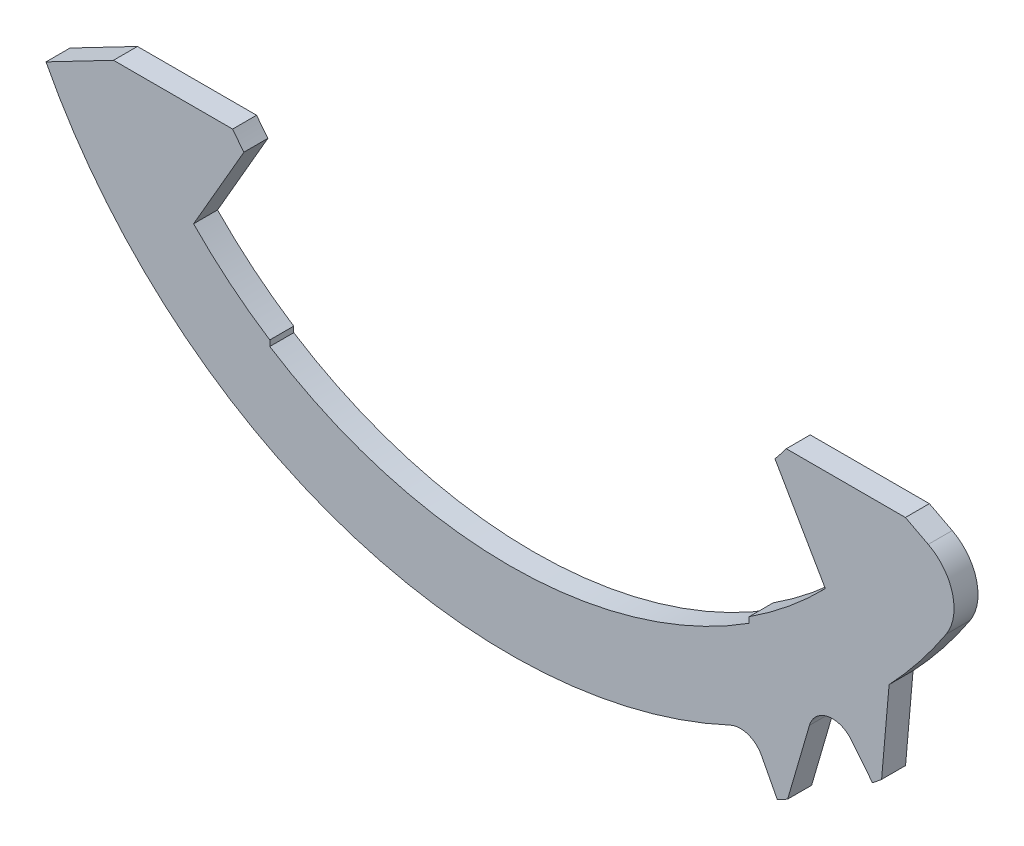
ISO-10303-21;
HEADER;
FILE_DESCRIPTION(('STEP AP214'),'2;1');
FILE_NAME('part.step','',(''),(''),'','','');
FILE_SCHEMA(('AUTOMOTIVE_DESIGN { 1 0 10303 214 1 1 1 1 }'));
ENDSEC;
DATA;
#1=APPLICATION_CONTEXT('core data for automotive mechanical design processes');
#2=APPLICATION_PROTOCOL_DEFINITION('international standard','automotive_design',2000,#1);
#3=PRODUCT_CONTEXT('',#1,'mechanical');
#4=PRODUCT('Part','Part','',(#3));
#5=PRODUCT_RELATED_PRODUCT_CATEGORY('part','',(#4));
#6=PRODUCT_DEFINITION_FORMATION('','',#4);
#7=PRODUCT_DEFINITION_CONTEXT('part definition',#1,'design');
#8=PRODUCT_DEFINITION('design','',#6,#7);
#9=PRODUCT_DEFINITION_SHAPE('','',#8);
#10=(LENGTH_UNIT() NAMED_UNIT(*) SI_UNIT(.MILLI.,.METRE.));
#11=(NAMED_UNIT(*) PLANE_ANGLE_UNIT() SI_UNIT($,.RADIAN.));
#12=(NAMED_UNIT(*) SI_UNIT($,.STERADIAN.) SOLID_ANGLE_UNIT());
#13=UNCERTAINTY_MEASURE_WITH_UNIT(LENGTH_MEASURE(1.E-05),#10,'distance_accuracy_value','');
#14=(GEOMETRIC_REPRESENTATION_CONTEXT(3) GLOBAL_UNCERTAINTY_ASSIGNED_CONTEXT((#13)) GLOBAL_UNIT_ASSIGNED_CONTEXT((#10,
#11,#12)) REPRESENTATION_CONTEXT('',''));
#15=CARTESIAN_POINT('',(0.,0.,0.));
#16=DIRECTION('',(0.,0.,1.));
#17=DIRECTION('',(1.,0.,0.));
#18=AXIS2_PLACEMENT_3D('',#15,#16,#17);
#19=CARTESIAN_POINT('',(4.81536330400592,-10.3330671269683,-0.00100000000000002));
#20=DIRECTION('',(0.,0.,1.));
#21=DIRECTION('',(1.,0.,0.));
#22=AXIS2_PLACEMENT_3D('',#19,#20,#21);
#23=CYLINDRICAL_SURFACE('',#22,0.5);
#24=DIRECTION('',(0.,0.,1.));
#25=VECTOR('',#24,1.);
#26=CARTESIAN_POINT('',(4.60416315909338,-9.87986242841707,-0.00100000000000002));
#27=LINE('',#26,#25);
#28=CARTESIAN_POINT('',(4.60416315909338,-9.87986242841707,0.));
#29=VERTEX_POINT('',#28);
#30=CARTESIAN_POINT('',(4.60416315909338,-9.87986242841707,0.5));
#31=VERTEX_POINT('',#30);
#32=EDGE_CURVE('E233',#29,#31,#27,.T.);
#33=ORIENTED_EDGE('',*,*,#32,.F.);
#34=CARTESIAN_POINT('',(4.81536330400592,-10.3330671269683,0.));
#35=DIRECTION('',(0.,0.,-1.));
#36=DIRECTION('',(-1.,0.,0.));
#37=AXIS2_PLACEMENT_3D('',#34,#35,#36);
#38=CIRCLE('',#37,0.5);
#39=CARTESIAN_POINT('',(5.25886872059503,-10.1021928203508,0.));
#40=VERTEX_POINT('',#39);
#41=EDGE_CURVE('E384',#40,#29,#38,.F.);
#42=ORIENTED_EDGE('',*,*,#41,.F.);
#43=DIRECTION('',(0.,0.,1.));
#44=VECTOR('',#43,1.);
#45=CARTESIAN_POINT('',(5.25886872059503,-10.1021928203508,-0.00100000000000002));
#46=LINE('',#45,#44);
#47=CARTESIAN_POINT('',(5.25886872059503,-10.1021928203508,0.5));
#48=VERTEX_POINT('',#47);
#49=EDGE_CURVE('E393',#40,#48,#46,.T.);
#50=ORIENTED_EDGE('',*,*,#49,.T.);
#51=CARTESIAN_POINT('',(4.81536330400592,-10.3330671269683,0.5));
#52=DIRECTION('',(0.,0.,1.));
#53=DIRECTION('',(0.195090322016125,0.980785280403231,0.));
#54=AXIS2_PLACEMENT_3D('',#51,#52,#53);
#55=CIRCLE('',#54,0.5);
#56=EDGE_CURVE('E390',#48,#31,#55,.T.);
#57=ORIENTED_EDGE('',*,*,#56,.T.);
#58=EDGE_LOOP('',(#33,#42,#50,#57));
#59=FACE_BOUND('',#58,.T.);
#60=ADVANCED_FACE('F68',(#59),#23,.F.);
#61=CARTESIAN_POINT('',(0.,0.,0.5));
#62=DIRECTION('',(0.,0.,-1.));
#63=DIRECTION('',(-1.,0.,0.));
#64=AXIS2_PLACEMENT_3D('',#61,#62,#63);
#65=CYLINDRICAL_SURFACE('',#64,12.1);
#66=CARTESIAN_POINT('',(0.,0.,0.));
#67=DIRECTION('',(0.,0.,1.));
#68=DIRECTION('',(1.,0.,0.));
#69=AXIS2_PLACEMENT_3D('',#66,#67,#68);
#70=CIRCLE('',#69,12.1);
#71=CARTESIAN_POINT('',(7.57367401342711,-9.43660224542387,0.));
#72=VERTEX_POINT('',#71);
#73=CARTESIAN_POINT('',(7.76317902804415,-9.28132810423893,0.));
#74=VERTEX_POINT('',#73);
#75=EDGE_CURVE('E288',#72,#74,#70,.T.);
#76=ORIENTED_EDGE('',*,*,#75,.T.);
#77=DIRECTION('',(0.,0.,1.));
#78=VECTOR('',#77,1.);
#79=CARTESIAN_POINT('',(7.76317902804415,-9.28132810423893,-0.00100000000000002));
#80=LINE('',#79,#78);
#81=CARTESIAN_POINT('',(7.76317902804415,-9.28132810423893,0.5));
#82=VERTEX_POINT('',#81);
#83=EDGE_CURVE('E355',#74,#82,#80,.T.);
#84=ORIENTED_EDGE('',*,*,#83,.T.);
#85=CARTESIAN_POINT('',(0.,0.,0.5));
#86=DIRECTION('',(0.,0.,1.));
#87=DIRECTION('',(1.,0.,0.));
#88=AXIS2_PLACEMENT_3D('',#85,#86,#87);
#89=CIRCLE('',#88,12.1);
#90=CARTESIAN_POINT('',(7.57367401342711,-9.43660224542387,0.5));
#91=VERTEX_POINT('',#90);
#92=EDGE_CURVE('E251',#91,#82,#89,.T.);
#93=ORIENTED_EDGE('',*,*,#92,.F.);
#94=DIRECTION('',(0.,0.,1.));
#95=VECTOR('',#94,1.);
#96=CARTESIAN_POINT('',(7.57367401342711,-9.43660224542387,-0.00100000000000002));
#97=LINE('',#96,#95);
#98=EDGE_CURVE('E372',#72,#91,#97,.T.);
#99=ORIENTED_EDGE('',*,*,#98,.F.);
#100=EDGE_LOOP('',(#76,#84,#93,#99));
#101=FACE_BOUND('',#100,.T.);
#102=ADVANCED_FACE('F434',(#101),#65,.T.);
#103=CARTESIAN_POINT('',(5.5871582201439,-10.7328310814565,0.));
#104=VERTEX_POINT('',#103);
#105=CARTESIAN_POINT('',(5.80331443124744,-10.6175110836804,0.));
#106=VERTEX_POINT('',#105);
#107=EDGE_CURVE('E291',#104,#106,#70,.T.);
#108=ORIENTED_EDGE('',*,*,#107,.T.);
#109=DIRECTION('',(0.,0.,1.));
#110=VECTOR('',#109,1.);
#111=CARTESIAN_POINT('',(5.80331443124744,-10.6175110836804,-0.00100000000000002));
#112=LINE('',#111,#110);
#113=CARTESIAN_POINT('',(5.80331443124744,-10.6175110836804,0.5));
#114=VERTEX_POINT('',#113);
#115=EDGE_CURVE('E373',#106,#114,#112,.T.);
#116=ORIENTED_EDGE('',*,*,#115,.T.);
#117=CARTESIAN_POINT('',(5.5871582201439,-10.7328310814565,0.5));
#118=VERTEX_POINT('',#117);
#119=EDGE_CURVE('E254',#118,#114,#89,.T.);
#120=ORIENTED_EDGE('',*,*,#119,.F.);
#121=DIRECTION('',(0.,0.,1.));
#122=VECTOR('',#121,1.);
#123=CARTESIAN_POINT('',(5.5871582201439,-10.7328310814565,-0.00100000000000002));
#124=LINE('',#123,#122);
#125=EDGE_CURVE('E392',#104,#118,#124,.T.);
#126=ORIENTED_EDGE('',*,*,#125,.F.);
#127=EDGE_LOOP('',(#108,#116,#120,#126));
#128=FACE_BOUND('',#127,.T.);
#129=ADVANCED_FACE('F451',(#128),#65,.T.);
#130=CARTESIAN_POINT('',(0.,0.,0.5));
#131=DIRECTION('',(0.,0.,-1.));
#132=DIRECTION('',(-1.,0.,0.));
#133=AXIS2_PLACEMENT_3D('',#130,#131,#132);
#134=CYLINDRICAL_SURFACE('',#133,7.2);
#135=CARTESIAN_POINT('',(0.,0.,0.));
#136=DIRECTION('',(0.,0.,-1.));
#137=DIRECTION('',(-1.,0.,0.));
#138=AXIS2_PLACEMENT_3D('',#135,#136,#137);
#139=CIRCLE('',#138,7.2);
#140=CARTESIAN_POINT('',(5.77494588719236,-4.3,0.));
#141=VERTEX_POINT('',#140);
#142=CARTESIAN_POINT('',(5.53923133011576,-4.5996647999027,0.));
#143=VERTEX_POINT('',#142);
#144=EDGE_CURVE('E265',#141,#143,#139,.T.);
#145=ORIENTED_EDGE('',*,*,#144,.T.);
#146=DIRECTION('',(0.,0.,-1.));
#147=VECTOR('',#146,1.);
#148=CARTESIAN_POINT('',(5.53923133011576,-4.5996647999027,0.5));
#149=LINE('',#148,#147);
#150=CARTESIAN_POINT('',(5.53923133011576,-4.5996647999027,0.5));
#151=VERTEX_POINT('',#150);
#152=EDGE_CURVE('E328',#151,#143,#149,.T.);
#153=ORIENTED_EDGE('',*,*,#152,.F.);
#154=CARTESIAN_POINT('',(0.,0.,0.5));
#155=DIRECTION('',(0.,0.,-1.));
#156=DIRECTION('',(-1.,0.,0.));
#157=AXIS2_PLACEMENT_3D('',#154,#155,#156);
#158=CIRCLE('',#157,7.2);
#159=CARTESIAN_POINT('',(5.77494588719236,-4.3,0.5));
#160=VERTEX_POINT('',#159);
#161=EDGE_CURVE('E296',#160,#151,#158,.T.);
#162=ORIENTED_EDGE('',*,*,#161,.F.);
#163=DIRECTION('',(0.,0.,-1.));
#164=VECTOR('',#163,1.);
#165=CARTESIAN_POINT('',(5.77494588719236,-4.3,0.5));
#166=LINE('',#165,#164);
#167=EDGE_CURVE('E264',#160,#141,#166,.T.);
#168=ORIENTED_EDGE('',*,*,#167,.T.);
#169=EDGE_LOOP('',(#145,#153,#162,#168));
#170=FACE_BOUND('',#169,.T.);
#171=ADVANCED_FACE('F512',(#170),#134,.F.);
#172=CARTESIAN_POINT('',(5.53923133011576,-4.5996647999027,0.5));
#173=DIRECTION('',(0.866025403784438,0.500000000000001,0.));
#174=DIRECTION('',(-0.500000000000001,0.866025403784438,0.));
#175=AXIS2_PLACEMENT_3D('',#172,#173,#174);
#176=PLANE('',#175);
#177=DIRECTION('',(0.500000000000001,-0.866025403784438,0.));
#178=VECTOR('',#177,1.);
#179=CARTESIAN_POINT('',(5.53923133011576,-4.5996647999027,0.));
#180=LINE('',#179,#178);
#181=CARTESIAN_POINT('',(6.59,-6.41964952314377,0.));
#182=VERTEX_POINT('',#181);
#183=EDGE_CURVE('E268',#143,#182,#180,.T.);
#184=ORIENTED_EDGE('',*,*,#183,.T.);
#185=DIRECTION('',(0.,0.,-1.));
#186=VECTOR('',#185,1.);
#187=CARTESIAN_POINT('',(6.59,-6.41964952314377,0.5));
#188=LINE('',#187,#186);
#189=CARTESIAN_POINT('',(6.59,-6.41964952314377,0.5));
#190=VERTEX_POINT('',#189);
#191=EDGE_CURVE('E325',#190,#182,#188,.T.);
#192=ORIENTED_EDGE('',*,*,#191,.F.);
#193=DIRECTION('',(0.500000000000001,-0.866025403784438,0.));
#194=VECTOR('',#193,1.);
#195=CARTESIAN_POINT('',(5.53923133011576,-4.5996647999027,0.5));
#196=LINE('',#195,#194);
#197=EDGE_CURVE('E400',#151,#190,#196,.T.);
#198=ORIENTED_EDGE('',*,*,#197,.F.);
#199=ORIENTED_EDGE('',*,*,#152,.T.);
#200=EDGE_LOOP('',(#184,#192,#198,#199));
#201=FACE_BOUND('',#200,.T.);
#202=ADVANCED_FACE('F509',(#201),#176,.F.);
#203=CARTESIAN_POINT('',(0.,0.,0.5));
#204=DIRECTION('',(0.,0.,-1.));
#205=DIRECTION('',(-1.,0.,0.));
#206=AXIS2_PLACEMENT_3D('',#203,#204,#205);
#207=CYLINDRICAL_SURFACE('',#206,9.2);
#208=CARTESIAN_POINT('',(0.,0.,0.));
#209=DIRECTION('',(0.,0.,-1.));
#210=DIRECTION('',(1.,0.,0.));
#211=AXIS2_PLACEMENT_3D('',#208,#209,#210);
#212=CIRCLE('',#211,9.2);
#213=CARTESIAN_POINT('',(5.,-7.72269383052313,0.));
#214=VERTEX_POINT('',#213);
#215=EDGE_CURVE('E271',#182,#214,#212,.T.);
#216=ORIENTED_EDGE('',*,*,#215,.T.);
#217=DIRECTION('',(0.,0.,-1.));
#218=VECTOR('',#217,1.);
#219=CARTESIAN_POINT('',(5.,-7.72269383052313,0.5));
#220=LINE('',#219,#218);
#221=CARTESIAN_POINT('',(5.,-7.72269383052313,0.5));
#222=VERTEX_POINT('',#221);
#223=EDGE_CURVE('E322',#222,#214,#220,.T.);
#224=ORIENTED_EDGE('',*,*,#223,.F.);
#225=CARTESIAN_POINT('',(0.,0.,0.5));
#226=DIRECTION('',(0.,0.,-1.));
#227=DIRECTION('',(1.,0.,0.));
#228=AXIS2_PLACEMENT_3D('',#225,#226,#227);
#229=CIRCLE('',#228,9.2);
#230=EDGE_CURVE('E402',#190,#222,#229,.T.);
#231=ORIENTED_EDGE('',*,*,#230,.F.);
#232=ORIENTED_EDGE('',*,*,#191,.T.);
#233=EDGE_LOOP('',(#216,#224,#231,#232));
#234=FACE_BOUND('',#233,.T.);
#235=ADVANCED_FACE('F505',(#234),#207,.F.);
#236=CARTESIAN_POINT('',(5.,-7.72269383052313,0.5));
#237=DIRECTION('',(1.,0.,0.));
#238=DIRECTION('',(0.,0.,-1.));
#239=AXIS2_PLACEMENT_3D('',#236,#237,#238);
#240=PLANE('',#239);
#241=DIRECTION('',(0.,-1.,0.));
#242=VECTOR('',#241,1.);
#243=CARTESIAN_POINT('',(5.,-7.72269383052313,0.));
#244=LINE('',#243,#242);
#245=CARTESIAN_POINT('',(4.99999999999999,-7.84155596804614,0.));
#246=VERTEX_POINT('',#245);
#247=EDGE_CURVE('E273',#214,#246,#244,.T.);
#248=ORIENTED_EDGE('',*,*,#247,.T.);
#249=DIRECTION('',(0.,0.,-1.));
#250=VECTOR('',#249,1.);
#251=CARTESIAN_POINT('',(4.99999999999999,-7.84155596804614,0.5));
#252=LINE('',#251,#250);
#253=CARTESIAN_POINT('',(4.99999999999999,-7.84155596804614,0.5));
#254=VERTEX_POINT('',#253);
#255=EDGE_CURVE('E319',#254,#246,#252,.T.);
#256=ORIENTED_EDGE('',*,*,#255,.F.);
#257=DIRECTION('',(0.,-1.,0.));
#258=VECTOR('',#257,1.);
#259=CARTESIAN_POINT('',(5.,-7.72269383052313,0.5));
#260=LINE('',#259,#258);
#261=EDGE_CURVE('E404',#222,#254,#260,.T.);
#262=ORIENTED_EDGE('',*,*,#261,.F.);
#263=ORIENTED_EDGE('',*,*,#223,.T.);
#264=EDGE_LOOP('',(#248,#256,#262,#263));
#265=FACE_BOUND('',#264,.T.);
#266=ADVANCED_FACE('F501',(#265),#240,.F.);
#267=CARTESIAN_POINT('',(0.,0.,0.5));
#268=DIRECTION('',(0.,0.,-1.));
#269=DIRECTION('',(-1.,0.,0.));
#270=AXIS2_PLACEMENT_3D('',#267,#268,#269);
#271=CYLINDRICAL_SURFACE('',#270,9.3);
#272=CARTESIAN_POINT('',(0.,0.,0.));
#273=DIRECTION('',(0.,0.,-1.));
#274=DIRECTION('',(1.,0.,0.));
#275=AXIS2_PLACEMENT_3D('',#272,#273,#274);
#276=CIRCLE('',#275,9.3);
#277=CARTESIAN_POINT('',(-5.,-7.84155596804614,0.));
#278=VERTEX_POINT('',#277);
#279=EDGE_CURVE('E275',#246,#278,#276,.T.);
#280=ORIENTED_EDGE('',*,*,#279,.T.);
#281=DIRECTION('',(0.,0.,-1.));
#282=VECTOR('',#281,1.);
#283=CARTESIAN_POINT('',(-5.,-7.84155596804614,0.5));
#284=LINE('',#283,#282);
#285=CARTESIAN_POINT('',(-5.,-7.84155596804614,0.5));
#286=VERTEX_POINT('',#285);
#287=EDGE_CURVE('E316',#286,#278,#284,.T.);
#288=ORIENTED_EDGE('',*,*,#287,.F.);
#289=CARTESIAN_POINT('',(0.,0.,0.5));
#290=DIRECTION('',(0.,0.,-1.));
#291=DIRECTION('',(1.,0.,0.));
#292=AXIS2_PLACEMENT_3D('',#289,#290,#291);
#293=CIRCLE('',#292,9.3);
#294=EDGE_CURVE('E406',#254,#286,#293,.T.);
#295=ORIENTED_EDGE('',*,*,#294,.F.);
#296=ORIENTED_EDGE('',*,*,#255,.T.);
#297=EDGE_LOOP('',(#280,#288,#295,#296));
#298=FACE_BOUND('',#297,.T.);
#299=ADVANCED_FACE('F497',(#298),#271,.F.);
#300=CARTESIAN_POINT('',(-5.,-7.72269383052313,0.5));
#301=DIRECTION('',(-1.,0.,0.));
#302=DIRECTION('',(0.,0.,1.));
#303=AXIS2_PLACEMENT_3D('',#300,#301,#302);
#304=PLANE('',#303);
#305=DIRECTION('',(0.,1.,0.));
#306=VECTOR('',#305,1.);
#307=CARTESIAN_POINT('',(-5.,-7.72269383052313,0.));
#308=LINE('',#307,#306);
#309=CARTESIAN_POINT('',(-5.00000000000001,-7.72269383052313,0.));
#310=VERTEX_POINT('',#309);
#311=EDGE_CURVE('E277',#278,#310,#308,.T.);
#312=ORIENTED_EDGE('',*,*,#311,.T.);
#313=DIRECTION('',(0.,0.,-1.));
#314=VECTOR('',#313,1.);
#315=CARTESIAN_POINT('',(-5.00000000000001,-7.72269383052313,0.5));
#316=LINE('',#315,#314);
#317=CARTESIAN_POINT('',(-5.00000000000001,-7.72269383052313,0.5));
#318=VERTEX_POINT('',#317);
#319=EDGE_CURVE('E313',#318,#310,#316,.T.);
#320=ORIENTED_EDGE('',*,*,#319,.F.);
#321=DIRECTION('',(0.,1.,0.));
#322=VECTOR('',#321,1.);
#323=CARTESIAN_POINT('',(-5.,-7.72269383052313,0.5));
#324=LINE('',#323,#322);
#325=EDGE_CURVE('E408',#286,#318,#324,.T.);
#326=ORIENTED_EDGE('',*,*,#325,.F.);
#327=ORIENTED_EDGE('',*,*,#287,.T.);
#328=EDGE_LOOP('',(#312,#320,#326,#327));
#329=FACE_BOUND('',#328,.T.);
#330=ADVANCED_FACE('F493',(#329),#304,.F.);
#331=CARTESIAN_POINT('',(0.,0.,0.5));
#332=DIRECTION('',(0.,0.,-1.));
#333=DIRECTION('',(-1.,0.,0.));
#334=AXIS2_PLACEMENT_3D('',#331,#332,#333);
#335=CYLINDRICAL_SURFACE('',#334,9.2);
#336=CARTESIAN_POINT('',(0.,0.,0.));
#337=DIRECTION('',(0.,0.,-1.));
#338=DIRECTION('',(1.,0.,0.));
#339=AXIS2_PLACEMENT_3D('',#336,#337,#338);
#340=CIRCLE('',#339,9.2);
#341=CARTESIAN_POINT('',(-6.59,-6.41964952314377,0.));
#342=VERTEX_POINT('',#341);
#343=EDGE_CURVE('E279',#310,#342,#340,.T.);
#344=ORIENTED_EDGE('',*,*,#343,.T.);
#345=DIRECTION('',(0.,0.,-1.));
#346=VECTOR('',#345,1.);
#347=CARTESIAN_POINT('',(-6.59,-6.41964952314377,0.5));
#348=LINE('',#347,#346);
#349=CARTESIAN_POINT('',(-6.59,-6.41964952314377,0.5));
#350=VERTEX_POINT('',#349);
#351=EDGE_CURVE('E310',#350,#342,#348,.T.);
#352=ORIENTED_EDGE('',*,*,#351,.F.);
#353=CARTESIAN_POINT('',(0.,0.,0.5));
#354=DIRECTION('',(0.,0.,-1.));
#355=DIRECTION('',(1.,0.,0.));
#356=AXIS2_PLACEMENT_3D('',#353,#354,#355);
#357=CIRCLE('',#356,9.2);
#358=EDGE_CURVE('E410',#318,#350,#357,.T.);
#359=ORIENTED_EDGE('',*,*,#358,.F.);
#360=ORIENTED_EDGE('',*,*,#319,.T.);
#361=EDGE_LOOP('',(#344,#352,#359,#360));
#362=FACE_BOUND('',#361,.T.);
#363=ADVANCED_FACE('F489',(#362),#335,.F.);
#364=CARTESIAN_POINT('',(-5.53923133011576,-4.5996647999027,0.5));
#365=DIRECTION('',(-0.866025403784438,0.500000000000001,0.));
#366=DIRECTION('',(-0.500000000000001,-0.866025403784438,0.));
#367=AXIS2_PLACEMENT_3D('',#364,#365,#366);
#368=PLANE('',#367);
#369=DIRECTION('',(0.500000000000001,0.866025403784438,0.));
#370=VECTOR('',#369,1.);
#371=CARTESIAN_POINT('',(-5.53923133011576,-4.5996647999027,0.));
#372=LINE('',#371,#370);
#373=CARTESIAN_POINT('',(-5.53923133011576,-4.5996647999027,0.));
#374=VERTEX_POINT('',#373);
#375=EDGE_CURVE('E281',#342,#374,#372,.T.);
#376=ORIENTED_EDGE('',*,*,#375,.T.);
#377=DIRECTION('',(0.,0.,-1.));
#378=VECTOR('',#377,1.);
#379=CARTESIAN_POINT('',(-5.53923133011576,-4.5996647999027,0.5));
#380=LINE('',#379,#378);
#381=CARTESIAN_POINT('',(-5.53923133011576,-4.5996647999027,0.5));
#382=VERTEX_POINT('',#381);
#383=EDGE_CURVE('E307',#382,#374,#380,.T.);
#384=ORIENTED_EDGE('',*,*,#383,.F.);
#385=DIRECTION('',(0.500000000000001,0.866025403784438,0.));
#386=VECTOR('',#385,1.);
#387=CARTESIAN_POINT('',(-5.53923133011576,-4.5996647999027,0.5));
#388=LINE('',#387,#386);
#389=EDGE_CURVE('E412',#350,#382,#388,.T.);
#390=ORIENTED_EDGE('',*,*,#389,.F.);
#391=ORIENTED_EDGE('',*,*,#351,.T.);
#392=EDGE_LOOP('',(#376,#384,#390,#391));
#393=FACE_BOUND('',#392,.T.);
#394=ADVANCED_FACE('F486',(#393),#368,.F.);
#395=CARTESIAN_POINT('',(0.,0.,0.5));
#396=DIRECTION('',(0.,0.,-1.));
#397=DIRECTION('',(-1.,0.,0.));
#398=AXIS2_PLACEMENT_3D('',#395,#396,#397);
#399=CYLINDRICAL_SURFACE('',#398,7.2);
#400=CARTESIAN_POINT('',(0.,0.,0.));
#401=DIRECTION('',(0.,0.,-1.));
#402=DIRECTION('',(1.,0.,0.));
#403=AXIS2_PLACEMENT_3D('',#400,#401,#402);
#404=CIRCLE('',#403,7.2);
#405=CARTESIAN_POINT('',(-5.77494588719236,-4.3,0.));
#406=VERTEX_POINT('',#405);
#407=EDGE_CURVE('E283',#374,#406,#404,.T.);
#408=ORIENTED_EDGE('',*,*,#407,.T.);
#409=DIRECTION('',(0.,0.,-1.));
#410=VECTOR('',#409,1.);
#411=CARTESIAN_POINT('',(-5.77494588719236,-4.3,0.5));
#412=LINE('',#411,#410);
#413=CARTESIAN_POINT('',(-5.77494588719236,-4.3,0.5));
#414=VERTEX_POINT('',#413);
#415=EDGE_CURVE('E304',#414,#406,#412,.T.);
#416=ORIENTED_EDGE('',*,*,#415,.F.);
#417=CARTESIAN_POINT('',(0.,0.,0.5));
#418=DIRECTION('',(0.,0.,-1.));
#419=DIRECTION('',(1.,0.,0.));
#420=AXIS2_PLACEMENT_3D('',#417,#418,#419);
#421=CIRCLE('',#420,7.2);
#422=EDGE_CURVE('E256',#382,#414,#421,.T.);
#423=ORIENTED_EDGE('',*,*,#422,.F.);
#424=ORIENTED_EDGE('',*,*,#383,.T.);
#425=EDGE_LOOP('',(#408,#416,#423,#424));
#426=FACE_BOUND('',#425,.T.);
#427=ADVANCED_FACE('F418',(#426),#399,.F.);
#428=CARTESIAN_POINT('',(-8.26022314597606,-4.3,0.5));
#429=DIRECTION('',(0.,-1.,0.));
#430=DIRECTION('',(1.,0.,0.));
#431=AXIS2_PLACEMENT_3D('',#428,#429,#430);
#432=PLANE('',#431);
#433=DIRECTION('',(-1.,0.,0.));
#434=VECTOR('',#433,1.);
#435=CARTESIAN_POINT('',(-8.26022314597606,-4.3,0.));
#436=LINE('',#435,#434);
#437=CARTESIAN_POINT('',(-8.26022314597606,-4.3,0.));
#438=VERTEX_POINT('',#437);
#439=EDGE_CURVE('E285',#406,#438,#436,.T.);
#440=ORIENTED_EDGE('',*,*,#439,.T.);
#441=DIRECTION('',(0.,0.,-1.));
#442=VECTOR('',#441,1.);
#443=CARTESIAN_POINT('',(-8.26022314597606,-4.3,0.5));
#444=LINE('',#443,#442);
#445=CARTESIAN_POINT('',(-8.26022314597606,-4.3,0.5));
#446=VERTEX_POINT('',#445);
#447=EDGE_CURVE('E302',#446,#438,#444,.T.);
#448=ORIENTED_EDGE('',*,*,#447,.F.);
#449=DIRECTION('',(-1.,0.,0.));
#450=VECTOR('',#449,1.);
#451=CARTESIAN_POINT('',(-8.26022314597606,-4.3,0.5));
#452=LINE('',#451,#450);
#453=EDGE_CURVE('E249',#414,#446,#452,.T.);
#454=ORIENTED_EDGE('',*,*,#453,.F.);
#455=ORIENTED_EDGE('',*,*,#415,.T.);
#456=EDGE_LOOP('',(#440,#448,#454,#455));
#457=FACE_BOUND('',#456,.T.);
#458=ADVANCED_FACE('F422',(#457),#432,.F.);
#459=CARTESIAN_POINT('',(-8.26022314597606,-4.3,0.5));
#460=DIRECTION('',(0.461748613235031,-0.887010833178223,0.));
#461=DIRECTION('',(0.887010833178223,0.461748613235031,0.));
#462=AXIS2_PLACEMENT_3D('',#459,#460,#461);
#463=PLANE('',#462);
#464=DIRECTION('',(-0.887010833178223,-0.461748613235031,0.));
#465=VECTOR('',#464,1.);
#466=CARTESIAN_POINT('',(-8.26022314597606,-4.3,0.));
#467=LINE('',#466,#465);
#468=CARTESIAN_POINT('',(-9.66841808164263,-5.03305988426184,0.));
#469=VERTEX_POINT('',#468);
#470=EDGE_CURVE('E245',#438,#469,#467,.T.);
#471=ORIENTED_EDGE('',*,*,#470,.T.);
#472=DIRECTION('',(0.,0.,1.));
#473=VECTOR('',#472,1.);
#474=CARTESIAN_POINT('',(-9.66841808164263,-5.03305988426184,-0.00100000000000002));
#475=LINE('',#474,#473);
#476=CARTESIAN_POINT('',(-9.66841808164263,-5.03305988426184,0.5));
#477=VERTEX_POINT('',#476);
#478=EDGE_CURVE('E230',#469,#477,#475,.T.);
#479=ORIENTED_EDGE('',*,*,#478,.T.);
#480=DIRECTION('',(-0.887010833178223,-0.461748613235031,0.));
#481=VECTOR('',#480,1.);
#482=CARTESIAN_POINT('',(-8.26022314597606,-4.3,0.5));
#483=LINE('',#482,#481);
#484=EDGE_CURVE('E243',#446,#477,#483,.T.);
#485=ORIENTED_EDGE('',*,*,#484,.F.);
#486=ORIENTED_EDGE('',*,*,#447,.T.);
#487=EDGE_LOOP('',(#471,#479,#485,#486));
#488=FACE_BOUND('',#487,.T.);
#489=ADVANCED_FACE('F241',(#488),#463,.F.);
#490=CARTESIAN_POINT('',(8.26022314597606,-4.3,0.5));
#491=DIRECTION('',(-0.461748613235032,-0.887010833178223,0.));
#492=DIRECTION('',(0.887010833178223,-0.461748613235032,0.));
#493=AXIS2_PLACEMENT_3D('',#490,#491,#492);
#494=PLANE('',#493);
#495=DIRECTION('',(-0.887010833178223,0.461748613235032,0.));
#496=VECTOR('',#495,1.);
#497=CARTESIAN_POINT('',(8.26022314597606,-4.3,0.5));
#498=LINE('',#497,#496);
#499=CARTESIAN_POINT('',(8.73649386454358,-4.54793084322885,0.5));
#500=VERTEX_POINT('',#499);
#501=CARTESIAN_POINT('',(8.26022314597606,-4.3,0.5));
#502=VERTEX_POINT('',#501);
#503=EDGE_CURVE('E260',#500,#502,#498,.T.);
#504=ORIENTED_EDGE('',*,*,#503,.F.);
#505=DIRECTION('',(0.,0.,1.));
#506=VECTOR('',#505,1.);
#507=CARTESIAN_POINT('',(8.73649386454358,-4.54793084322885,0.5));
#508=LINE('',#507,#506);
#509=CARTESIAN_POINT('',(8.73649386454358,-4.54793084322885,0.));
#510=VERTEX_POINT('',#509);
#511=EDGE_CURVE('E76',#500,#510,#508,.F.);
#512=ORIENTED_EDGE('',*,*,#511,.T.);
#513=DIRECTION('',(-0.887010833178223,0.461748613235032,0.));
#514=VECTOR('',#513,1.);
#515=CARTESIAN_POINT('',(8.26022314597606,-4.3,0.));
#516=LINE('',#515,#514);
#517=CARTESIAN_POINT('',(8.26022314597606,-4.3,0.));
#518=VERTEX_POINT('',#517);
#519=EDGE_CURVE('E292',#510,#518,#516,.T.);
#520=ORIENTED_EDGE('',*,*,#519,.T.);
#521=DIRECTION('',(0.,0.,-1.));
#522=VECTOR('',#521,1.);
#523=CARTESIAN_POINT('',(8.26022314597606,-4.3,0.5));
#524=LINE('',#523,#522);
#525=EDGE_CURVE('E299',#502,#518,#524,.T.);
#526=ORIENTED_EDGE('',*,*,#525,.F.);
#527=EDGE_LOOP('',(#504,#512,#520,#526));
#528=FACE_BOUND('',#527,.T.);
#529=ADVANCED_FACE('F476',(#528),#494,.F.);
#530=CARTESIAN_POINT('',(5.77494588719236,-4.3,0.5));
#531=DIRECTION('',(0.,-1.,0.));
#532=DIRECTION('',(1.,0.,0.));
#533=AXIS2_PLACEMENT_3D('',#530,#531,#532);
#534=PLANE('',#533);
#535=DIRECTION('',(-1.,0.,0.));
#536=VECTOR('',#535,1.);
#537=CARTESIAN_POINT('',(5.77494588719236,-4.3,0.));
#538=LINE('',#537,#536);
#539=EDGE_CURVE('E294',#518,#141,#538,.T.);
#540=ORIENTED_EDGE('',*,*,#539,.T.);
#541=ORIENTED_EDGE('',*,*,#167,.F.);
#542=DIRECTION('',(-1.,0.,0.));
#543=VECTOR('',#542,1.);
#544=CARTESIAN_POINT('',(5.77494588719236,-4.3,0.5));
#545=LINE('',#544,#543);
#546=EDGE_CURVE('E262',#502,#160,#545,.T.);
#547=ORIENTED_EDGE('',*,*,#546,.F.);
#548=ORIENTED_EDGE('',*,*,#525,.T.);
#549=EDGE_LOOP('',(#540,#541,#547,#548));
#550=FACE_BOUND('',#549,.T.);
#551=ADVANCED_FACE('F471',(#550),#534,.F.);
#552=CARTESIAN_POINT('',(0.,0.,0.5));
#553=DIRECTION('',(0.,0.,-1.));
#554=DIRECTION('',(-1.,0.,0.));
#555=AXIS2_PLACEMENT_3D('',#552,#553,#554);
#556=PLANE('',#555);
#557=ORIENTED_EDGE('',*,*,#484,.T.);
#558=CARTESIAN_POINT('',(0.,0.,0.5));
#559=DIRECTION('',(0.,0.,-1.));
#560=DIRECTION('',(1.,0.,0.));
#561=AXIS2_PLACEMENT_3D('',#558,#559,#560);
#562=CIRCLE('',#561,10.9);
#563=EDGE_CURVE('E227',#31,#477,#562,.T.);
#564=ORIENTED_EDGE('',*,*,#563,.F.);
#565=ORIENTED_EDGE('',*,*,#56,.F.);
#566=DIRECTION('',(-0.461748613235033,0.887010833178222,0.));
#567=VECTOR('',#566,1.);
#568=CARTESIAN_POINT('',(5.25886872059503,-10.1021928203508,0.5));
#569=LINE('',#568,#567);
#570=EDGE_CURVE('E387',#118,#48,#569,.T.);
#571=ORIENTED_EDGE('',*,*,#570,.F.);
#572=ORIENTED_EDGE('',*,*,#119,.T.);
#573=DIRECTION('',(-0.279829014030988,-0.96004985438593,0.));
#574=VECTOR('',#573,1.);
#575=CARTESIAN_POINT('',(5.80331443124744,-10.6175110836804,0.5));
#576=LINE('',#575,#574);
#577=CARTESIAN_POINT('',(6.25869391438443,-9.05517485493036,0.5));
#578=VERTEX_POINT('',#577);
#579=EDGE_CURVE('E370',#578,#114,#576,.T.);
#580=ORIENTED_EDGE('',*,*,#579,.F.);
#581=CARTESIAN_POINT('',(6.73871884157739,-9.19508936194586,0.5));
#582=DIRECTION('',(0.,0.,1.));
#583=DIRECTION('',(0.,1.,0.));
#584=AXIS2_PLACEMENT_3D('',#581,#582,#583);
#585=CIRCLE('',#584,0.5);
#586=CARTESIAN_POINT('',(7.12866108312383,-8.88212762585383,0.5));
#587=VERTEX_POINT('',#586);
#588=EDGE_CURVE('E367',#587,#578,#585,.T.);
#589=ORIENTED_EDGE('',*,*,#588,.F.);
#590=DIRECTION('',(-0.625923472184058,0.779884483092882,0.));
#591=VECTOR('',#590,1.);
#592=CARTESIAN_POINT('',(7.12866108312383,-8.88212762585383,0.5));
#593=LINE('',#592,#591);
#594=EDGE_CURVE('E364',#91,#587,#593,.T.);
#595=ORIENTED_EDGE('',*,*,#594,.F.);
#596=ORIENTED_EDGE('',*,*,#92,.T.);
#597=DIRECTION('',(-0.0871557427476539,-0.996194698091746,0.));
#598=VECTOR('',#597,1.);
#599=CARTESIAN_POINT('',(7.76317902804415,-9.28132810423893,0.5));
#600=LINE('',#599,#598);
#601=CARTESIAN_POINT('',(7.91999592597633,-7.48890275891724,0.5));
#602=VERTEX_POINT('',#601);
#603=EDGE_CURVE('E344',#602,#82,#600,.T.);
#604=ORIENTED_EDGE('',*,*,#603,.F.);
#605=CARTESIAN_POINT('',(0.,0.,0.5));
#606=DIRECTION('',(0.,0.,-1.));
#607=DIRECTION('',(-1.,0.,0.));
#608=AXIS2_PLACEMENT_3D('',#605,#606,#607);
#609=CIRCLE('',#608,10.9);
#610=CARTESIAN_POINT('',(9.11057810497609,-5.98392568412496,0.5));
#611=VERTEX_POINT('',#610);
#612=EDGE_CURVE('E339',#611,#602,#609,.T.);
#613=ORIENTED_EDGE('',*,*,#612,.F.);
#614=CARTESIAN_POINT('',(8.27474525130855,-5.43494167640707,0.5));
#615=DIRECTION('',(0.,0.,-1.));
#616=DIRECTION('',(-1.,0.,0.));
#617=AXIS2_PLACEMENT_3D('',#614,#615,#616);
#618=CIRCLE('',#617,1.);
#619=EDGE_CURVE('E90',#611,#500,#618,.F.);
#620=ORIENTED_EDGE('',*,*,#619,.T.);
#621=ORIENTED_EDGE('',*,*,#503,.T.);
#622=ORIENTED_EDGE('',*,*,#546,.T.);
#623=ORIENTED_EDGE('',*,*,#161,.T.);
#624=ORIENTED_EDGE('',*,*,#197,.T.);
#625=ORIENTED_EDGE('',*,*,#230,.T.);
#626=ORIENTED_EDGE('',*,*,#261,.T.);
#627=ORIENTED_EDGE('',*,*,#294,.T.);
#628=ORIENTED_EDGE('',*,*,#325,.T.);
#629=ORIENTED_EDGE('',*,*,#358,.T.);
#630=ORIENTED_EDGE('',*,*,#389,.T.);
#631=ORIENTED_EDGE('',*,*,#422,.T.);
#632=ORIENTED_EDGE('',*,*,#453,.T.);
#633=EDGE_LOOP('',(#557,#564,#565,#571,#572,#580,#589,#595,#596,#604,#613,#620,#621,#622,#623,
#624,#625,#626,#627,#628,#629,#630,#631,#632));
#634=FACE_BOUND('',#633,.T.);
#635=ADVANCED_FACE('F247',(#634),#556,.F.);
#636=CARTESIAN_POINT('',(0.,0.,0.));
#637=DIRECTION('',(0.,0.,-1.));
#638=DIRECTION('',(-1.,0.,0.));
#639=AXIS2_PLACEMENT_3D('',#636,#637,#638);
#640=PLANE('',#639);
#641=CARTESIAN_POINT('',(0.,0.,0.));
#642=DIRECTION('',(0.,0.,-1.));
#643=DIRECTION('',(-1.,0.,0.));
#644=AXIS2_PLACEMENT_3D('',#641,#642,#643);
#645=CIRCLE('',#644,10.9);
#646=EDGE_CURVE('E237',#29,#469,#645,.T.);
#647=ORIENTED_EDGE('',*,*,#646,.T.);
#648=ORIENTED_EDGE('',*,*,#470,.F.);
#649=ORIENTED_EDGE('',*,*,#439,.F.);
#650=ORIENTED_EDGE('',*,*,#407,.F.);
#651=ORIENTED_EDGE('',*,*,#375,.F.);
#652=ORIENTED_EDGE('',*,*,#343,.F.);
#653=ORIENTED_EDGE('',*,*,#311,.F.);
#654=ORIENTED_EDGE('',*,*,#279,.F.);
#655=ORIENTED_EDGE('',*,*,#247,.F.);
#656=ORIENTED_EDGE('',*,*,#215,.F.);
#657=ORIENTED_EDGE('',*,*,#183,.F.);
#658=ORIENTED_EDGE('',*,*,#144,.F.);
#659=ORIENTED_EDGE('',*,*,#539,.F.);
#660=ORIENTED_EDGE('',*,*,#519,.F.);
#661=CARTESIAN_POINT('',(8.27474525130855,-5.43494167640707,0.));
#662=DIRECTION('',(0.,0.,-1.));
#663=DIRECTION('',(-1.,0.,0.));
#664=AXIS2_PLACEMENT_3D('',#661,#662,#663);
#665=CIRCLE('',#664,1.);
#666=CARTESIAN_POINT('',(9.11057810497609,-5.98392568412496,0.));
#667=VERTEX_POINT('',#666);
#668=EDGE_CURVE('E14',#510,#667,#665,.T.);
#669=ORIENTED_EDGE('',*,*,#668,.T.);
#670=CARTESIAN_POINT('',(0.,0.,0.));
#671=DIRECTION('',(0.,0.,-1.));
#672=DIRECTION('',(-1.,0.,0.));
#673=AXIS2_PLACEMENT_3D('',#670,#671,#672);
#674=CIRCLE('',#673,10.9);
#675=CARTESIAN_POINT('',(7.91999592597633,-7.48890275891724,0.));
#676=VERTEX_POINT('',#675);
#677=EDGE_CURVE('E341',#667,#676,#674,.T.);
#678=ORIENTED_EDGE('',*,*,#677,.T.);
#679=DIRECTION('',(-0.0871557427476539,-0.996194698091746,0.));
#680=VECTOR('',#679,1.);
#681=CARTESIAN_POINT('',(7.76317902804415,-9.28132810423893,0.));
#682=LINE('',#681,#680);
#683=EDGE_CURVE('E346',#676,#74,#682,.T.);
#684=ORIENTED_EDGE('',*,*,#683,.T.);
#685=ORIENTED_EDGE('',*,*,#75,.F.);
#686=DIRECTION('',(-0.625923472184058,0.779884483092882,0.));
#687=VECTOR('',#686,1.);
#688=CARTESIAN_POINT('',(7.12866108312383,-8.88212762585383,0.));
#689=LINE('',#688,#687);
#690=CARTESIAN_POINT('',(7.12866108312383,-8.88212762585383,0.));
#691=VERTEX_POINT('',#690);
#692=EDGE_CURVE('E376',#72,#691,#689,.T.);
#693=ORIENTED_EDGE('',*,*,#692,.T.);
#694=CARTESIAN_POINT('',(6.73871884157739,-9.19508936194586,0.));
#695=DIRECTION('',(0.,0.,-1.));
#696=DIRECTION('',(-1.,0.,0.));
#697=AXIS2_PLACEMENT_3D('',#694,#695,#696);
#698=CIRCLE('',#697,0.5);
#699=CARTESIAN_POINT('',(6.25869391438443,-9.05517485493036,0.));
#700=VERTEX_POINT('',#699);
#701=EDGE_CURVE('E358',#691,#700,#698,.F.);
#702=ORIENTED_EDGE('',*,*,#701,.T.);
#703=DIRECTION('',(-0.279829014030988,-0.96004985438593,0.));
#704=VECTOR('',#703,1.);
#705=CARTESIAN_POINT('',(5.80331443124744,-10.6175110836804,0.));
#706=LINE('',#705,#704);
#707=EDGE_CURVE('E361',#700,#106,#706,.T.);
#708=ORIENTED_EDGE('',*,*,#707,.T.);
#709=ORIENTED_EDGE('',*,*,#107,.F.);
#710=DIRECTION('',(-0.461748613235033,0.887010833178222,0.));
#711=VECTOR('',#710,1.);
#712=CARTESIAN_POINT('',(5.25886872059503,-10.1021928203508,0.));
#713=LINE('',#712,#711);
#714=EDGE_CURVE('E269',#104,#40,#713,.T.);
#715=ORIENTED_EDGE('',*,*,#714,.T.);
#716=ORIENTED_EDGE('',*,*,#41,.T.);
#717=EDGE_LOOP('',(#647,#648,#649,#650,#651,#652,#653,#654,#655,#656,#657,#658,#659,#660,#669,
#678,#684,#685,#693,#702,#708,#709,#715,#716));
#718=FACE_BOUND('',#717,.T.);
#719=ADVANCED_FACE('F424',(#718),#640,.T.);
#720=CARTESIAN_POINT('',(5.25886872059503,-10.1021928203508,-0.00100000000000002));
#721=DIRECTION('',(0.887010833178222,0.461748613235033,0.));
#722=DIRECTION('',(-0.461748613235033,0.887010833178222,0.));
#723=AXIS2_PLACEMENT_3D('',#720,#721,#722);
#724=PLANE('',#723);
#725=ORIENTED_EDGE('',*,*,#125,.T.);
#726=ORIENTED_EDGE('',*,*,#570,.T.);
#727=ORIENTED_EDGE('',*,*,#49,.F.);
#728=ORIENTED_EDGE('',*,*,#714,.F.);
#729=EDGE_LOOP('',(#725,#726,#727,#728));
#730=FACE_BOUND('',#729,.T.);
#731=ADVANCED_FACE('F455',(#730),#724,.F.);
#732=CARTESIAN_POINT('',(5.80331443124744,-10.6175110836804,-0.00100000000000002));
#733=DIRECTION('',(-0.96004985438593,0.279829014030988,0.));
#734=DIRECTION('',(-0.279829014030988,-0.96004985438593,0.));
#735=AXIS2_PLACEMENT_3D('',#732,#733,#734);
#736=PLANE('',#735);
#737=DIRECTION('',(0.,0.,1.));
#738=VECTOR('',#737,1.);
#739=CARTESIAN_POINT('',(6.25869391438443,-9.05517485493036,-0.00100000000000002));
#740=LINE('',#739,#738);
#741=EDGE_CURVE('E377',#700,#578,#740,.T.);
#742=ORIENTED_EDGE('',*,*,#741,.T.);
#743=ORIENTED_EDGE('',*,*,#579,.T.);
#744=ORIENTED_EDGE('',*,*,#115,.F.);
#745=ORIENTED_EDGE('',*,*,#707,.F.);
#746=EDGE_LOOP('',(#742,#743,#744,#745));
#747=FACE_BOUND('',#746,.T.);
#748=ADVANCED_FACE('F468',(#747),#736,.F.);
#749=CARTESIAN_POINT('',(6.73871884157739,-9.19508936194586,-0.00100000000000002));
#750=DIRECTION('',(0.,0.,1.));
#751=DIRECTION('',(1.,0.,0.));
#752=AXIS2_PLACEMENT_3D('',#749,#750,#751);
#753=CYLINDRICAL_SURFACE('',#752,0.5);
#754=DIRECTION('',(0.,0.,1.));
#755=VECTOR('',#754,1.);
#756=CARTESIAN_POINT('',(7.12866108312383,-8.88212762585383,-0.00100000000000002));
#757=LINE('',#756,#755);
#758=EDGE_CURVE('E379',#691,#587,#757,.T.);
#759=ORIENTED_EDGE('',*,*,#758,.T.);
#760=ORIENTED_EDGE('',*,*,#588,.T.);
#761=ORIENTED_EDGE('',*,*,#741,.F.);
#762=ORIENTED_EDGE('',*,*,#701,.F.);
#763=EDGE_LOOP('',(#759,#760,#761,#762));
#764=FACE_BOUND('',#763,.T.);
#765=ADVANCED_FACE('F444',(#764),#753,.F.);
#766=CARTESIAN_POINT('',(7.12866108312383,-8.88212762585383,-0.00100000000000002));
#767=DIRECTION('',(0.779884483092882,0.625923472184058,0.));
#768=DIRECTION('',(-0.625923472184058,0.779884483092882,0.));
#769=AXIS2_PLACEMENT_3D('',#766,#767,#768);
#770=PLANE('',#769);
#771=ORIENTED_EDGE('',*,*,#98,.T.);
#772=ORIENTED_EDGE('',*,*,#594,.T.);
#773=ORIENTED_EDGE('',*,*,#758,.F.);
#774=ORIENTED_EDGE('',*,*,#692,.F.);
#775=EDGE_LOOP('',(#771,#772,#773,#774));
#776=FACE_BOUND('',#775,.T.);
#777=ADVANCED_FACE('F438',(#776),#770,.F.);
#778=CARTESIAN_POINT('',(7.76317902804415,-9.28132810423893,-0.00100000000000002));
#779=DIRECTION('',(-0.996194698091746,0.0871557427476539,0.));
#780=DIRECTION('',(-0.0871557427476539,-0.996194698091746,0.));
#781=AXIS2_PLACEMENT_3D('',#778,#779,#780);
#782=PLANE('',#781);
#783=ORIENTED_EDGE('',*,*,#683,.F.);
#784=DIRECTION('',(0.,0.,1.));
#785=VECTOR('',#784,1.);
#786=CARTESIAN_POINT('',(7.91999592597633,-7.48890275891724,-0.00100000000000002));
#787=LINE('',#786,#785);
#788=EDGE_CURVE('E350',#676,#602,#787,.T.);
#789=ORIENTED_EDGE('',*,*,#788,.T.);
#790=ORIENTED_EDGE('',*,*,#603,.T.);
#791=ORIENTED_EDGE('',*,*,#83,.F.);
#792=EDGE_LOOP('',(#783,#789,#790,#791));
#793=FACE_BOUND('',#792,.T.);
#794=ADVANCED_FACE('F430',(#793),#782,.F.);
#795=CARTESIAN_POINT('',(0.,0.,-0.00100000000000002));
#796=DIRECTION('',(0.,0.,1.));
#797=DIRECTION('',(1.,0.,0.));
#798=AXIS2_PLACEMENT_3D('',#795,#796,#797);
#799=CYLINDRICAL_SURFACE('',#798,10.9);
#800=ORIENTED_EDGE('',*,*,#677,.F.);
#801=DIRECTION('',(0.,0.,1.));
#802=VECTOR('',#801,1.);
#803=CARTESIAN_POINT('',(9.11057810497609,-5.98392568412496,-0.00100000000000002));
#804=LINE('',#803,#802);
#805=EDGE_CURVE('E331',#667,#611,#804,.T.);
#806=ORIENTED_EDGE('',*,*,#805,.T.);
#807=ORIENTED_EDGE('',*,*,#612,.T.);
#808=ORIENTED_EDGE('',*,*,#788,.F.);
#809=EDGE_LOOP('',(#800,#806,#807,#808));
#810=FACE_BOUND('',#809,.T.);
#811=ADVANCED_FACE('F337',(#810),#799,.T.);
#812=CARTESIAN_POINT('',(8.27474525130855,-5.43494167640707,-0.00100000000000002));
#813=DIRECTION('',(0.,0.,1.));
#814=DIRECTION('',(1.,0.,0.));
#815=AXIS2_PLACEMENT_3D('',#812,#813,#814);
#816=CYLINDRICAL_SURFACE('',#815,1.);
#817=ORIENTED_EDGE('',*,*,#668,.F.);
#818=ORIENTED_EDGE('',*,*,#511,.F.);
#819=ORIENTED_EDGE('',*,*,#619,.F.);
#820=ORIENTED_EDGE('',*,*,#805,.F.);
#821=EDGE_LOOP('',(#817,#818,#819,#820));
#822=FACE_BOUND('',#821,.T.);
#823=ADVANCED_FACE('F70',(#822),#816,.T.);
#824=CARTESIAN_POINT('',(0.,0.,-0.00100000000000002));
#825=DIRECTION('',(0.,0.,1.));
#826=DIRECTION('',(1.,0.,0.));
#827=AXIS2_PLACEMENT_3D('',#824,#825,#826);
#828=CYLINDRICAL_SURFACE('',#827,10.9);
#829=ORIENTED_EDGE('',*,*,#646,.F.);
#830=ORIENTED_EDGE('',*,*,#32,.T.);
#831=ORIENTED_EDGE('',*,*,#563,.T.);
#832=ORIENTED_EDGE('',*,*,#478,.F.);
#833=EDGE_LOOP('',(#829,#830,#831,#832));
#834=FACE_BOUND('',#833,.T.);
#835=ADVANCED_FACE('F229',(#834),#828,.T.);
#836=CLOSED_SHELL('',(#60,#102,#129,#171,#202,#235,#266,#299,#330,#363,#394,#427,#458,#489,#529,
#551,#635,#719,#731,#748,#765,#777,#794,#811,#823,#835));
#837=MANIFOLD_SOLID_BREP('B2',#836);
#838=ADVANCED_BREP_SHAPE_REPRESENTATION('',(#18,#837),#14);
#839=SHAPE_DEFINITION_REPRESENTATION(#9,#838);
ENDSEC;
END-ISO-10303-21;
